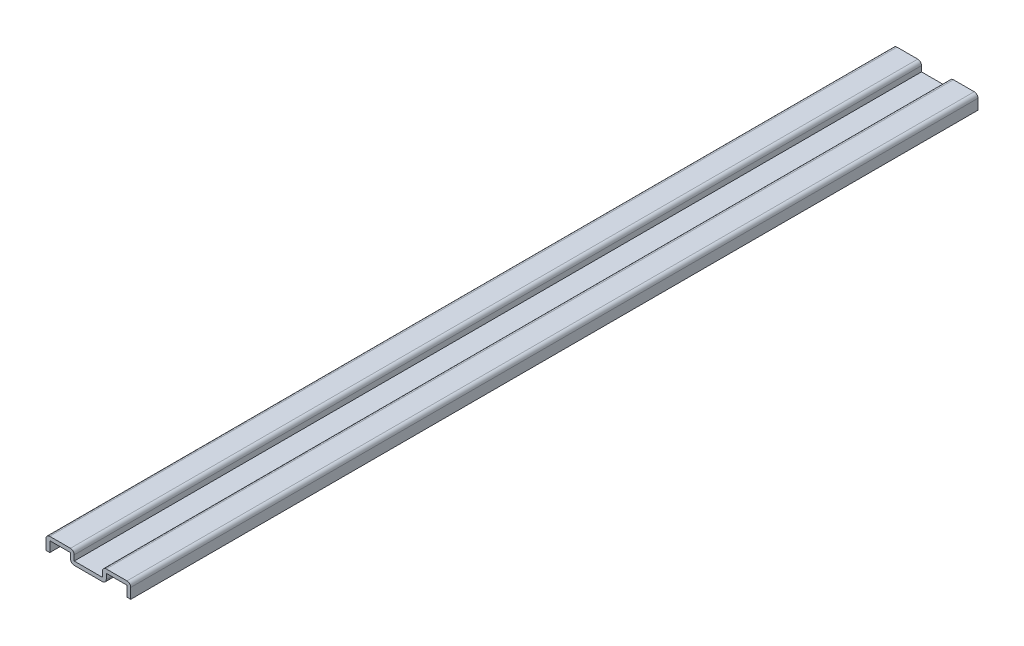
ISO-10303-21;
HEADER;
FILE_DESCRIPTION(('STEP AP214'),'2;1');
FILE_NAME('part.step','',(''),(''),'','','');
FILE_SCHEMA(('AUTOMOTIVE_DESIGN { 1 0 10303 214 1 1 1 1 }'));
ENDSEC;
DATA;
#1=APPLICATION_CONTEXT('core data for automotive mechanical design processes');
#2=APPLICATION_PROTOCOL_DEFINITION('international standard','automotive_design',2000,#1);
#3=PRODUCT_CONTEXT('',#1,'mechanical');
#4=PRODUCT('Part','Part','',(#3));
#5=PRODUCT_RELATED_PRODUCT_CATEGORY('part','',(#4));
#6=PRODUCT_DEFINITION_FORMATION('','',#4);
#7=PRODUCT_DEFINITION_CONTEXT('part definition',#1,'design');
#8=PRODUCT_DEFINITION('design','',#6,#7);
#9=PRODUCT_DEFINITION_SHAPE('','',#8);
#10=(LENGTH_UNIT() NAMED_UNIT(*) SI_UNIT(.MILLI.,.METRE.));
#11=(NAMED_UNIT(*) PLANE_ANGLE_UNIT() SI_UNIT($,.RADIAN.));
#12=(NAMED_UNIT(*) SI_UNIT($,.STERADIAN.) SOLID_ANGLE_UNIT());
#13=UNCERTAINTY_MEASURE_WITH_UNIT(LENGTH_MEASURE(1.E-05),#10,'distance_accuracy_value','');
#14=(GEOMETRIC_REPRESENTATION_CONTEXT(3) GLOBAL_UNCERTAINTY_ASSIGNED_CONTEXT((#13)) GLOBAL_UNIT_ASSIGNED_CONTEXT((#10,
#11,#12)) REPRESENTATION_CONTEXT('',''));
#15=CARTESIAN_POINT('',(0.,0.,0.));
#16=DIRECTION('',(0.,0.,1.));
#17=DIRECTION('',(1.,0.,0.));
#18=AXIS2_PLACEMENT_3D('',#15,#16,#17);
#19=CARTESIAN_POINT('',(-14.2875,0.,-285.75));
#20=DIRECTION('',(-1.,0.,0.));
#21=DIRECTION('',(0.,0.,1.));
#22=AXIS2_PLACEMENT_3D('',#19,#20,#21);
#23=PLANE('',#22);
#24=DIRECTION('',(0.,-1.,0.));
#25=VECTOR('',#24,1.);
#26=CARTESIAN_POINT('',(-14.2875,0.,0.));
#27=LINE('',#26,#25);
#28=CARTESIAN_POINT('',(-14.2875,3.4925,0.));
#29=VERTEX_POINT('',#28);
#30=CARTESIAN_POINT('',(-14.2875,0.,0.));
#31=VERTEX_POINT('',#30);
#32=EDGE_CURVE('E327',#29,#31,#27,.T.);
#33=ORIENTED_EDGE('',*,*,#32,.F.);
#34=DIRECTION('',(0.,0.,1.));
#35=VECTOR('',#34,1.);
#36=CARTESIAN_POINT('',(-14.2875,3.4925,-285.75));
#37=LINE('',#36,#35);
#38=CARTESIAN_POINT('',(-14.2875,3.4925,-285.75));
#39=VERTEX_POINT('',#38);
#40=EDGE_CURVE('E11',#29,#39,#37,.F.);
#41=ORIENTED_EDGE('',*,*,#40,.T.);
#42=DIRECTION('',(0.,-1.,0.));
#43=VECTOR('',#42,1.);
#44=CARTESIAN_POINT('',(-14.2875,0.,-285.75));
#45=LINE('',#44,#43);
#46=CARTESIAN_POINT('',(-14.2875,0.,-285.75));
#47=VERTEX_POINT('',#46);
#48=EDGE_CURVE('E185',#39,#47,#45,.T.);
#49=ORIENTED_EDGE('',*,*,#48,.T.);
#50=DIRECTION('',(0.,0.,1.));
#51=VECTOR('',#50,1.);
#52=CARTESIAN_POINT('',(-14.2875,0.,-285.75));
#53=LINE('',#52,#51);
#54=EDGE_CURVE('E189',#47,#31,#53,.T.);
#55=ORIENTED_EDGE('',*,*,#54,.T.);
#56=EDGE_LOOP('',(#33,#41,#49,#55));
#57=FACE_BOUND('',#56,.T.);
#58=ADVANCED_FACE('F35',(#57),#23,.T.);
#59=CARTESIAN_POINT('',(-14.2875,4.7625,-285.75));
#60=DIRECTION('',(0.,1.,0.));
#61=DIRECTION('',(0.,0.,1.));
#62=AXIS2_PLACEMENT_3D('',#59,#60,#61);
#63=PLANE('',#62);
#64=DIRECTION('',(-1.,0.,0.));
#65=VECTOR('',#64,1.);
#66=CARTESIAN_POINT('',(-14.2875,4.7625,0.));
#67=LINE('',#66,#65);
#68=CARTESIAN_POINT('',(-6.0325,4.7625,0.));
#69=VERTEX_POINT('',#68);
#70=CARTESIAN_POINT('',(-13.0175,4.7625,0.));
#71=VERTEX_POINT('',#70);
#72=EDGE_CURVE('E194',#69,#71,#67,.T.);
#73=ORIENTED_EDGE('',*,*,#72,.F.);
#74=DIRECTION('',(0.,0.,1.));
#75=VECTOR('',#74,1.);
#76=CARTESIAN_POINT('',(-6.0325,4.7625,-285.75));
#77=LINE('',#76,#75);
#78=CARTESIAN_POINT('',(-6.0325,4.7625,-285.75));
#79=VERTEX_POINT('',#78);
#80=EDGE_CURVE('E43',#69,#79,#77,.F.);
#81=ORIENTED_EDGE('',*,*,#80,.T.);
#82=DIRECTION('',(-1.,0.,0.));
#83=VECTOR('',#82,1.);
#84=CARTESIAN_POINT('',(-14.2875,4.7625,-285.75));
#85=LINE('',#84,#83);
#86=CARTESIAN_POINT('',(-13.0175,4.7625,-285.75));
#87=VERTEX_POINT('',#86);
#88=EDGE_CURVE('E209',#79,#87,#85,.T.);
#89=ORIENTED_EDGE('',*,*,#88,.T.);
#90=DIRECTION('',(0.,0.,1.));
#91=VECTOR('',#90,1.);
#92=CARTESIAN_POINT('',(-13.0175,4.7625,-285.75));
#93=LINE('',#92,#91);
#94=EDGE_CURVE('E264',#87,#71,#93,.T.);
#95=ORIENTED_EDGE('',*,*,#94,.T.);
#96=EDGE_LOOP('',(#73,#81,#89,#95));
#97=FACE_BOUND('',#96,.T.);
#98=ADVANCED_FACE('F270',(#97),#63,.T.);
#99=CARTESIAN_POINT('',(-4.7625,4.7625,-285.75));
#100=DIRECTION('',(1.,0.,0.));
#101=DIRECTION('',(0.,0.,-1.));
#102=AXIS2_PLACEMENT_3D('',#99,#100,#101);
#103=PLANE('',#102);
#104=DIRECTION('',(0.,1.,0.));
#105=VECTOR('',#104,1.);
#106=CARTESIAN_POINT('',(-4.7625,4.7625,-285.75));
#107=LINE('',#106,#105);
#108=CARTESIAN_POINT('',(-4.7625,1.666875,-285.75));
#109=VERTEX_POINT('',#108);
#110=CARTESIAN_POINT('',(-4.7625,3.4925,-285.75));
#111=VERTEX_POINT('',#110);
#112=EDGE_CURVE('E214',#109,#111,#107,.T.);
#113=ORIENTED_EDGE('',*,*,#112,.T.);
#114=DIRECTION('',(0.,0.,1.));
#115=VECTOR('',#114,1.);
#116=CARTESIAN_POINT('',(-4.7625,3.4925,-285.75));
#117=LINE('',#116,#115);
#118=CARTESIAN_POINT('',(-4.7625,3.4925,0.));
#119=VERTEX_POINT('',#118);
#120=EDGE_CURVE('E261',#111,#119,#117,.T.);
#121=ORIENTED_EDGE('',*,*,#120,.T.);
#122=DIRECTION('',(0.,1.,0.));
#123=VECTOR('',#122,1.);
#124=CARTESIAN_POINT('',(-4.7625,4.7625,0.));
#125=LINE('',#124,#123);
#126=CARTESIAN_POINT('',(-4.7625,1.666875,0.));
#127=VERTEX_POINT('',#126);
#128=EDGE_CURVE('E283',#127,#119,#125,.T.);
#129=ORIENTED_EDGE('',*,*,#128,.F.);
#130=DIRECTION('',(0.,0.,1.));
#131=VECTOR('',#130,1.);
#132=CARTESIAN_POINT('',(-4.7625,1.666875,-285.75));
#133=LINE('',#132,#131);
#134=EDGE_CURVE('E222',#109,#127,#133,.T.);
#135=ORIENTED_EDGE('',*,*,#134,.F.);
#136=EDGE_LOOP('',(#113,#121,#129,#135));
#137=FACE_BOUND('',#136,.T.);
#138=ADVANCED_FACE('F282',(#137),#103,.T.);
#139=CARTESIAN_POINT('',(-4.7625,1.666875,-285.75));
#140=DIRECTION('',(0.,1.,0.));
#141=DIRECTION('',(0.,0.,1.));
#142=AXIS2_PLACEMENT_3D('',#139,#140,#141);
#143=PLANE('',#142);
#144=DIRECTION('',(-1.,0.,0.));
#145=VECTOR('',#144,1.);
#146=CARTESIAN_POINT('',(-4.7625,1.666875,0.));
#147=LINE('',#146,#145);
#148=CARTESIAN_POINT('',(4.7625,1.666875,0.));
#149=VERTEX_POINT('',#148);
#150=EDGE_CURVE('E289',#149,#127,#147,.T.);
#151=ORIENTED_EDGE('',*,*,#150,.F.);
#152=DIRECTION('',(0.,0.,1.));
#153=VECTOR('',#152,1.);
#154=CARTESIAN_POINT('',(4.7625,1.666875,-285.75));
#155=LINE('',#154,#153);
#156=CARTESIAN_POINT('',(4.7625,1.666875,-285.75));
#157=VERTEX_POINT('',#156);
#158=EDGE_CURVE('E297',#157,#149,#155,.T.);
#159=ORIENTED_EDGE('',*,*,#158,.F.);
#160=DIRECTION('',(-1.,0.,0.));
#161=VECTOR('',#160,1.);
#162=CARTESIAN_POINT('',(-4.7625,1.666875,-285.75));
#163=LINE('',#162,#161);
#164=EDGE_CURVE('E358',#157,#109,#163,.T.);
#165=ORIENTED_EDGE('',*,*,#164,.T.);
#166=ORIENTED_EDGE('',*,*,#134,.T.);
#167=EDGE_LOOP('',(#151,#159,#165,#166));
#168=FACE_BOUND('',#167,.T.);
#169=ADVANCED_FACE('F357',(#168),#143,.T.);
#170=CARTESIAN_POINT('',(4.7625,4.7625,-285.75));
#171=DIRECTION('',(-1.,0.,0.));
#172=DIRECTION('',(0.,0.,1.));
#173=AXIS2_PLACEMENT_3D('',#170,#171,#172);
#174=PLANE('',#173);
#175=DIRECTION('',(0.,-1.,0.));
#176=VECTOR('',#175,1.);
#177=CARTESIAN_POINT('',(4.7625,4.7625,0.));
#178=LINE('',#177,#176);
#179=CARTESIAN_POINT('',(4.7625,3.4925,0.));
#180=VERTEX_POINT('',#179);
#181=EDGE_CURVE('E292',#180,#149,#178,.T.);
#182=ORIENTED_EDGE('',*,*,#181,.F.);
#183=DIRECTION('',(0.,0.,1.));
#184=VECTOR('',#183,1.);
#185=CARTESIAN_POINT('',(4.7625,3.4925,-285.75));
#186=LINE('',#185,#184);
#187=CARTESIAN_POINT('',(4.7625,3.4925,-285.75));
#188=VERTEX_POINT('',#187);
#189=EDGE_CURVE('E250',#180,#188,#186,.F.);
#190=ORIENTED_EDGE('',*,*,#189,.T.);
#191=DIRECTION('',(0.,-1.,0.));
#192=VECTOR('',#191,1.);
#193=CARTESIAN_POINT('',(4.7625,4.7625,-285.75));
#194=LINE('',#193,#192);
#195=EDGE_CURVE('E353',#188,#157,#194,.T.);
#196=ORIENTED_EDGE('',*,*,#195,.T.);
#197=ORIENTED_EDGE('',*,*,#158,.T.);
#198=EDGE_LOOP('',(#182,#190,#196,#197));
#199=FACE_BOUND('',#198,.T.);
#200=ADVANCED_FACE('F351',(#199),#174,.T.);
#201=CARTESIAN_POINT('',(14.2875,4.7625,-285.75));
#202=DIRECTION('',(0.,1.,0.));
#203=DIRECTION('',(0.,0.,1.));
#204=AXIS2_PLACEMENT_3D('',#201,#202,#203);
#205=PLANE('',#204);
#206=DIRECTION('',(-1.,0.,0.));
#207=VECTOR('',#206,1.);
#208=CARTESIAN_POINT('',(14.2875,4.7625,0.));
#209=LINE('',#208,#207);
#210=CARTESIAN_POINT('',(13.0175,4.7625,0.));
#211=VERTEX_POINT('',#210);
#212=CARTESIAN_POINT('',(6.0325,4.7625,0.));
#213=VERTEX_POINT('',#212);
#214=EDGE_CURVE('E345',#211,#213,#209,.T.);
#215=ORIENTED_EDGE('',*,*,#214,.F.);
#216=DIRECTION('',(0.,0.,1.));
#217=VECTOR('',#216,1.);
#218=CARTESIAN_POINT('',(13.0175,4.7625,-285.75));
#219=LINE('',#218,#217);
#220=CARTESIAN_POINT('',(13.0175,4.7625,-285.75));
#221=VERTEX_POINT('',#220);
#222=EDGE_CURVE('E237',#211,#221,#219,.F.);
#223=ORIENTED_EDGE('',*,*,#222,.T.);
#224=DIRECTION('',(-1.,0.,0.));
#225=VECTOR('',#224,1.);
#226=CARTESIAN_POINT('',(14.2875,4.7625,-285.75));
#227=LINE('',#226,#225);
#228=CARTESIAN_POINT('',(6.0325,4.7625,-285.75));
#229=VERTEX_POINT('',#228);
#230=EDGE_CURVE('E442',#221,#229,#227,.T.);
#231=ORIENTED_EDGE('',*,*,#230,.T.);
#232=DIRECTION('',(0.,0.,1.));
#233=VECTOR('',#232,1.);
#234=CARTESIAN_POINT('',(6.0325,4.7625,-285.75));
#235=LINE('',#234,#233);
#236=EDGE_CURVE('E234',#229,#213,#235,.T.);
#237=ORIENTED_EDGE('',*,*,#236,.T.);
#238=EDGE_LOOP('',(#215,#223,#231,#237));
#239=FACE_BOUND('',#238,.T.);
#240=ADVANCED_FACE('F438',(#239),#205,.T.);
#241=CARTESIAN_POINT('',(14.2875,0.,-285.75));
#242=DIRECTION('',(1.,0.,0.));
#243=DIRECTION('',(0.,0.,-1.));
#244=AXIS2_PLACEMENT_3D('',#241,#242,#243);
#245=PLANE('',#244);
#246=DIRECTION('',(0.,1.,0.));
#247=VECTOR('',#246,1.);
#248=CARTESIAN_POINT('',(14.2875,0.,-285.75));
#249=LINE('',#248,#247);
#250=CARTESIAN_POINT('',(14.2875,0.,-285.75));
#251=VERTEX_POINT('',#250);
#252=CARTESIAN_POINT('',(14.2875,3.4925,-285.75));
#253=VERTEX_POINT('',#252);
#254=EDGE_CURVE('E433',#251,#253,#249,.T.);
#255=ORIENTED_EDGE('',*,*,#254,.T.);
#256=DIRECTION('',(0.,0.,1.));
#257=VECTOR('',#256,1.);
#258=CARTESIAN_POINT('',(14.2875,3.4925,-285.75));
#259=LINE('',#258,#257);
#260=CARTESIAN_POINT('',(14.2875,3.4925,0.));
#261=VERTEX_POINT('',#260);
#262=EDGE_CURVE('E218',#253,#261,#259,.T.);
#263=ORIENTED_EDGE('',*,*,#262,.T.);
#264=DIRECTION('',(0.,1.,0.));
#265=VECTOR('',#264,1.);
#266=CARTESIAN_POINT('',(14.2875,0.,0.));
#267=LINE('',#266,#265);
#268=CARTESIAN_POINT('',(14.2875,0.,0.));
#269=VERTEX_POINT('',#268);
#270=EDGE_CURVE('E343',#269,#261,#267,.T.);
#271=ORIENTED_EDGE('',*,*,#270,.F.);
#272=DIRECTION('',(0.,0.,1.));
#273=VECTOR('',#272,1.);
#274=CARTESIAN_POINT('',(14.2875,0.,-285.75));
#275=LINE('',#274,#273);
#276=EDGE_CURVE('E300',#251,#269,#275,.T.);
#277=ORIENTED_EDGE('',*,*,#276,.F.);
#278=EDGE_LOOP('',(#255,#263,#271,#277));
#279=FACE_BOUND('',#278,.T.);
#280=ADVANCED_FACE('F432',(#279),#245,.T.);
#281=CARTESIAN_POINT('',(14.2875,0.,-285.75));
#282=DIRECTION('',(0.,1.,0.));
#283=DIRECTION('',(0.,0.,1.));
#284=AXIS2_PLACEMENT_3D('',#281,#282,#283);
#285=PLANE('',#284);
#286=DIRECTION('',(-1.,0.,0.));
#287=VECTOR('',#286,1.);
#288=CARTESIAN_POINT('',(14.2875,0.,0.));
#289=LINE('',#288,#287);
#290=CARTESIAN_POINT('',(13.0175,0.,0.));
#291=VERTEX_POINT('',#290);
#292=EDGE_CURVE('E341',#269,#291,#289,.T.);
#293=ORIENTED_EDGE('',*,*,#292,.T.);
#294=DIRECTION('',(0.,0.,1.));
#295=VECTOR('',#294,1.);
#296=CARTESIAN_POINT('',(13.0175,0.,-285.75));
#297=LINE('',#296,#295);
#298=CARTESIAN_POINT('',(13.0175,0.,-285.75));
#299=VERTEX_POINT('',#298);
#300=EDGE_CURVE('E302',#299,#291,#297,.T.);
#301=ORIENTED_EDGE('',*,*,#300,.F.);
#302=DIRECTION('',(-1.,0.,0.));
#303=VECTOR('',#302,1.);
#304=CARTESIAN_POINT('',(14.2875,0.,-285.75));
#305=LINE('',#304,#303);
#306=EDGE_CURVE('E428',#251,#299,#305,.T.);
#307=ORIENTED_EDGE('',*,*,#306,.F.);
#308=ORIENTED_EDGE('',*,*,#276,.T.);
#309=EDGE_LOOP('',(#293,#301,#307,#308));
#310=FACE_BOUND('',#309,.T.);
#311=ADVANCED_FACE('F427',(#310),#285,.F.);
#312=CARTESIAN_POINT('',(13.0175,0.,-285.75));
#313=DIRECTION('',(1.,0.,0.));
#314=DIRECTION('',(0.,0.,-1.));
#315=AXIS2_PLACEMENT_3D('',#312,#313,#314);
#316=PLANE('',#315);
#317=DIRECTION('',(0.,1.,0.));
#318=VECTOR('',#317,1.);
#319=CARTESIAN_POINT('',(13.0175,0.,0.));
#320=LINE('',#319,#318);
#321=CARTESIAN_POINT('',(13.0175,3.4925,0.));
#322=VERTEX_POINT('',#321);
#323=EDGE_CURVE('E339',#291,#322,#320,.T.);
#324=ORIENTED_EDGE('',*,*,#323,.T.);
#325=DIRECTION('',(0.,0.,1.));
#326=VECTOR('',#325,1.);
#327=CARTESIAN_POINT('',(13.0175,3.4925,-285.75));
#328=LINE('',#327,#326);
#329=CARTESIAN_POINT('',(13.0175,3.4925,-285.75));
#330=VERTEX_POINT('',#329);
#331=EDGE_CURVE('E305',#330,#322,#328,.T.);
#332=ORIENTED_EDGE('',*,*,#331,.F.);
#333=DIRECTION('',(0.,1.,0.));
#334=VECTOR('',#333,1.);
#335=CARTESIAN_POINT('',(13.0175,0.,-285.75));
#336=LINE('',#335,#334);
#337=EDGE_CURVE('E424',#299,#330,#336,.T.);
#338=ORIENTED_EDGE('',*,*,#337,.F.);
#339=ORIENTED_EDGE('',*,*,#300,.T.);
#340=EDGE_LOOP('',(#324,#332,#338,#339));
#341=FACE_BOUND('',#340,.T.);
#342=ADVANCED_FACE('F421',(#341),#316,.F.);
#343=CARTESIAN_POINT('',(14.2875,3.4925,-285.75));
#344=DIRECTION('',(0.,1.,0.));
#345=DIRECTION('',(0.,0.,1.));
#346=AXIS2_PLACEMENT_3D('',#343,#344,#345);
#347=PLANE('',#346);
#348=DIRECTION('',(1.,0.,0.));
#349=VECTOR('',#348,1.);
#350=CARTESIAN_POINT('',(14.2875,3.4925,0.));
#351=LINE('',#350,#349);
#352=CARTESIAN_POINT('',(6.0325,3.4925,0.));
#353=VERTEX_POINT('',#352);
#354=EDGE_CURVE('E337',#322,#353,#351,.F.);
#355=ORIENTED_EDGE('',*,*,#354,.T.);
#356=DIRECTION('',(0.,0.,1.));
#357=VECTOR('',#356,1.);
#358=CARTESIAN_POINT('',(6.0325,3.4925,-285.75));
#359=LINE('',#358,#357);
#360=CARTESIAN_POINT('',(6.0325,3.4925,-285.75));
#361=VERTEX_POINT('',#360);
#362=EDGE_CURVE('E308',#361,#353,#359,.T.);
#363=ORIENTED_EDGE('',*,*,#362,.F.);
#364=DIRECTION('',(1.,0.,0.));
#365=VECTOR('',#364,1.);
#366=CARTESIAN_POINT('',(14.2875,3.4925,-285.75));
#367=LINE('',#366,#365);
#368=EDGE_CURVE('E415',#330,#361,#367,.F.);
#369=ORIENTED_EDGE('',*,*,#368,.F.);
#370=ORIENTED_EDGE('',*,*,#331,.T.);
#371=EDGE_LOOP('',(#355,#363,#369,#370));
#372=FACE_BOUND('',#371,.T.);
#373=ADVANCED_FACE('F414',(#372),#347,.F.);
#374=CARTESIAN_POINT('',(6.0325,4.7625,-285.75));
#375=DIRECTION('',(-1.,0.,0.));
#376=DIRECTION('',(0.,0.,1.));
#377=AXIS2_PLACEMENT_3D('',#374,#375,#376);
#378=PLANE('',#377);
#379=DIRECTION('',(0.,1.,0.));
#380=VECTOR('',#379,1.);
#381=CARTESIAN_POINT('',(6.0325,4.7625,0.));
#382=LINE('',#381,#380);
#383=CARTESIAN_POINT('',(6.0325,1.666875,0.));
#384=VERTEX_POINT('',#383);
#385=EDGE_CURVE('E334',#353,#384,#382,.F.);
#386=ORIENTED_EDGE('',*,*,#385,.T.);
#387=DIRECTION('',(0.,0.,1.));
#388=VECTOR('',#387,1.);
#389=CARTESIAN_POINT('',(6.0325,1.666875,-285.75));
#390=LINE('',#389,#388);
#391=CARTESIAN_POINT('',(6.0325,1.666875,-285.75));
#392=VERTEX_POINT('',#391);
#393=EDGE_CURVE('E256',#384,#392,#390,.F.);
#394=ORIENTED_EDGE('',*,*,#393,.T.);
#395=DIRECTION('',(0.,1.,0.));
#396=VECTOR('',#395,1.);
#397=CARTESIAN_POINT('',(6.0325,4.7625,-285.75));
#398=LINE('',#397,#396);
#399=EDGE_CURVE('E411',#361,#392,#398,.F.);
#400=ORIENTED_EDGE('',*,*,#399,.F.);
#401=ORIENTED_EDGE('',*,*,#362,.T.);
#402=EDGE_LOOP('',(#386,#394,#400,#401));
#403=FACE_BOUND('',#402,.T.);
#404=ADVANCED_FACE('F407',(#403),#378,.F.);
#405=CARTESIAN_POINT('',(-4.7625,0.396875,-285.75));
#406=DIRECTION('',(0.,1.,0.));
#407=DIRECTION('',(0.,0.,1.));
#408=AXIS2_PLACEMENT_3D('',#405,#406,#407);
#409=PLANE('',#408);
#410=DIRECTION('',(1.,0.,0.));
#411=VECTOR('',#410,1.);
#412=CARTESIAN_POINT('',(-4.7625,0.396875,-285.75));
#413=LINE('',#412,#411);
#414=CARTESIAN_POINT('',(4.7625,0.396875,-285.75));
#415=VERTEX_POINT('',#414);
#416=CARTESIAN_POINT('',(-4.7625,0.396875,-285.75));
#417=VERTEX_POINT('',#416);
#418=EDGE_CURVE('E401',#415,#417,#413,.F.);
#419=ORIENTED_EDGE('',*,*,#418,.F.);
#420=DIRECTION('',(0.,0.,1.));
#421=VECTOR('',#420,1.);
#422=CARTESIAN_POINT('',(4.7625,0.396875,-285.75));
#423=LINE('',#422,#421);
#424=CARTESIAN_POINT('',(4.7625,0.396875,0.));
#425=VERTEX_POINT('',#424);
#426=EDGE_CURVE('E253',#415,#425,#423,.T.);
#427=ORIENTED_EDGE('',*,*,#426,.T.);
#428=DIRECTION('',(1.,0.,0.));
#429=VECTOR('',#428,1.);
#430=CARTESIAN_POINT('',(-4.7625,0.396875,0.));
#431=LINE('',#430,#429);
#432=CARTESIAN_POINT('',(-4.7625,0.396875,0.));
#433=VERTEX_POINT('',#432);
#434=EDGE_CURVE('E332',#425,#433,#431,.F.);
#435=ORIENTED_EDGE('',*,*,#434,.T.);
#436=DIRECTION('',(0.,0.,1.));
#437=VECTOR('',#436,1.);
#438=CARTESIAN_POINT('',(-4.7625,0.396875,-285.75));
#439=LINE('',#438,#437);
#440=EDGE_CURVE('E58',#433,#417,#439,.F.);
#441=ORIENTED_EDGE('',*,*,#440,.T.);
#442=EDGE_LOOP('',(#419,#427,#435,#441));
#443=FACE_BOUND('',#442,.T.);
#444=ADVANCED_FACE('F399',(#443),#409,.F.);
#445=CARTESIAN_POINT('',(-6.0325,4.7625,-285.75));
#446=DIRECTION('',(1.,0.,0.));
#447=DIRECTION('',(0.,0.,-1.));
#448=AXIS2_PLACEMENT_3D('',#445,#446,#447);
#449=PLANE('',#448);
#450=DIRECTION('',(0.,1.,0.));
#451=VECTOR('',#450,1.);
#452=CARTESIAN_POINT('',(-6.0325,4.7625,-285.75));
#453=LINE('',#452,#451);
#454=CARTESIAN_POINT('',(-6.0325,1.666875,-285.75));
#455=VERTEX_POINT('',#454);
#456=CARTESIAN_POINT('',(-6.0325,3.4925,-285.75));
#457=VERTEX_POINT('',#456);
#458=EDGE_CURVE('E397',#455,#457,#453,.T.);
#459=ORIENTED_EDGE('',*,*,#458,.F.);
#460=DIRECTION('',(0.,0.,1.));
#461=VECTOR('',#460,1.);
#462=CARTESIAN_POINT('',(-6.0325,1.666875,-285.75));
#463=LINE('',#462,#461);
#464=CARTESIAN_POINT('',(-6.0325,1.666875,0.));
#465=VERTEX_POINT('',#464);
#466=EDGE_CURVE('E258',#455,#465,#463,.T.);
#467=ORIENTED_EDGE('',*,*,#466,.T.);
#468=DIRECTION('',(0.,1.,0.));
#469=VECTOR('',#468,1.);
#470=CARTESIAN_POINT('',(-6.0325,4.7625,0.));
#471=LINE('',#470,#469);
#472=CARTESIAN_POINT('',(-6.0325,3.4925,0.));
#473=VERTEX_POINT('',#472);
#474=EDGE_CURVE('E325',#465,#473,#471,.T.);
#475=ORIENTED_EDGE('',*,*,#474,.T.);
#476=DIRECTION('',(0.,0.,1.));
#477=VECTOR('',#476,1.);
#478=CARTESIAN_POINT('',(-6.0325,3.4925,-285.75));
#479=LINE('',#478,#477);
#480=EDGE_CURVE('E311',#457,#473,#479,.T.);
#481=ORIENTED_EDGE('',*,*,#480,.F.);
#482=EDGE_LOOP('',(#459,#467,#475,#481));
#483=FACE_BOUND('',#482,.T.);
#484=ADVANCED_FACE('F395',(#483),#449,.F.);
#485=CARTESIAN_POINT('',(-14.2875,3.4925,-285.75));
#486=DIRECTION('',(0.,1.,0.));
#487=DIRECTION('',(0.,0.,1.));
#488=AXIS2_PLACEMENT_3D('',#485,#486,#487);
#489=PLANE('',#488);
#490=DIRECTION('',(1.,0.,0.));
#491=VECTOR('',#490,1.);
#492=CARTESIAN_POINT('',(-14.2875,3.4925,0.));
#493=LINE('',#492,#491);
#494=CARTESIAN_POINT('',(-13.0175,3.4925,0.));
#495=VERTEX_POINT('',#494);
#496=EDGE_CURVE('E323',#473,#495,#493,.F.);
#497=ORIENTED_EDGE('',*,*,#496,.T.);
#498=DIRECTION('',(0.,0.,1.));
#499=VECTOR('',#498,1.);
#500=CARTESIAN_POINT('',(-13.0175,3.4925,-285.75));
#501=LINE('',#500,#499);
#502=CARTESIAN_POINT('',(-13.0175,3.4925,-285.75));
#503=VERTEX_POINT('',#502);
#504=EDGE_CURVE('E211',#503,#495,#501,.T.);
#505=ORIENTED_EDGE('',*,*,#504,.F.);
#506=DIRECTION('',(1.,0.,0.));
#507=VECTOR('',#506,1.);
#508=CARTESIAN_POINT('',(-14.2875,3.4925,-285.75));
#509=LINE('',#508,#507);
#510=EDGE_CURVE('E453',#457,#503,#509,.F.);
#511=ORIENTED_EDGE('',*,*,#510,.F.);
#512=ORIENTED_EDGE('',*,*,#480,.T.);
#513=EDGE_LOOP('',(#497,#505,#511,#512));
#514=FACE_BOUND('',#513,.T.);
#515=ADVANCED_FACE('F455',(#514),#489,.F.);
#516=CARTESIAN_POINT('',(-13.0175,0.,-285.75));
#517=DIRECTION('',(-1.,0.,0.));
#518=DIRECTION('',(0.,0.,1.));
#519=AXIS2_PLACEMENT_3D('',#516,#517,#518);
#520=PLANE('',#519);
#521=DIRECTION('',(0.,1.,0.));
#522=VECTOR('',#521,1.);
#523=CARTESIAN_POINT('',(-13.0175,0.,0.));
#524=LINE('',#523,#522);
#525=CARTESIAN_POINT('',(-13.0175,0.,0.));
#526=VERTEX_POINT('',#525);
#527=EDGE_CURVE('E318',#495,#526,#524,.F.);
#528=ORIENTED_EDGE('',*,*,#527,.T.);
#529=DIRECTION('',(0.,0.,1.));
#530=VECTOR('',#529,1.);
#531=CARTESIAN_POINT('',(-13.0175,0.,-285.75));
#532=LINE('',#531,#530);
#533=CARTESIAN_POINT('',(-13.0175,0.,-285.75));
#534=VERTEX_POINT('',#533);
#535=EDGE_CURVE('E208',#534,#526,#532,.T.);
#536=ORIENTED_EDGE('',*,*,#535,.F.);
#537=DIRECTION('',(0.,1.,0.));
#538=VECTOR('',#537,1.);
#539=CARTESIAN_POINT('',(-13.0175,0.,-285.75));
#540=LINE('',#539,#538);
#541=EDGE_CURVE('E200',#503,#534,#540,.F.);
#542=ORIENTED_EDGE('',*,*,#541,.F.);
#543=ORIENTED_EDGE('',*,*,#504,.T.);
#544=EDGE_LOOP('',(#528,#536,#542,#543));
#545=FACE_BOUND('',#544,.T.);
#546=ADVANCED_FACE('F317',(#545),#520,.F.);
#547=CARTESIAN_POINT('',(-13.0175,0.,-285.75));
#548=DIRECTION('',(0.,1.,0.));
#549=DIRECTION('',(0.,0.,1.));
#550=AXIS2_PLACEMENT_3D('',#547,#548,#549);
#551=PLANE('',#550);
#552=DIRECTION('',(-1.,0.,0.));
#553=VECTOR('',#552,1.);
#554=CARTESIAN_POINT('',(-13.0175,0.,0.));
#555=LINE('',#554,#553);
#556=EDGE_CURVE('E207',#526,#31,#555,.T.);
#557=ORIENTED_EDGE('',*,*,#556,.T.);
#558=ORIENTED_EDGE('',*,*,#54,.F.);
#559=DIRECTION('',(-1.,0.,0.));
#560=VECTOR('',#559,1.);
#561=CARTESIAN_POINT('',(-13.0175,0.,-285.75));
#562=LINE('',#561,#560);
#563=EDGE_CURVE('E193',#534,#47,#562,.T.);
#564=ORIENTED_EDGE('',*,*,#563,.F.);
#565=ORIENTED_EDGE('',*,*,#535,.T.);
#566=EDGE_LOOP('',(#557,#558,#564,#565));
#567=FACE_BOUND('',#566,.T.);
#568=ADVANCED_FACE('F205',(#567),#551,.F.);
#569=CARTESIAN_POINT('',(0.,0.,-285.75));
#570=DIRECTION('',(0.,0.,-1.));
#571=DIRECTION('',(-1.,0.,0.));
#572=AXIS2_PLACEMENT_3D('',#569,#570,#571);
#573=PLANE('',#572);
#574=ORIENTED_EDGE('',*,*,#230,.F.);
#575=CARTESIAN_POINT('',(13.0175,3.4925,-285.75));
#576=DIRECTION('',(0.,0.,-1.));
#577=DIRECTION('',(-1.,0.,0.));
#578=AXIS2_PLACEMENT_3D('',#575,#576,#577);
#579=CIRCLE('',#578,1.27);
#580=EDGE_CURVE('E248',#221,#253,#579,.T.);
#581=ORIENTED_EDGE('',*,*,#580,.T.);
#582=ORIENTED_EDGE('',*,*,#254,.F.);
#583=ORIENTED_EDGE('',*,*,#306,.T.);
#584=ORIENTED_EDGE('',*,*,#337,.T.);
#585=ORIENTED_EDGE('',*,*,#368,.T.);
#586=ORIENTED_EDGE('',*,*,#399,.T.);
#587=CARTESIAN_POINT('',(4.7625,1.666875,-285.75));
#588=DIRECTION('',(0.,0.,-1.));
#589=DIRECTION('',(-1.,0.,0.));
#590=AXIS2_PLACEMENT_3D('',#587,#588,#589);
#591=CIRCLE('',#590,1.27);
#592=EDGE_CURVE('E244',#392,#415,#591,.T.);
#593=ORIENTED_EDGE('',*,*,#592,.T.);
#594=ORIENTED_EDGE('',*,*,#418,.T.);
#595=CARTESIAN_POINT('',(-4.7625,1.666875,-285.75));
#596=DIRECTION('',(0.,0.,-1.));
#597=DIRECTION('',(-1.,0.,0.));
#598=AXIS2_PLACEMENT_3D('',#595,#596,#597);
#599=CIRCLE('',#598,1.27);
#600=EDGE_CURVE('E50',#417,#455,#599,.T.);
#601=ORIENTED_EDGE('',*,*,#600,.T.);
#602=ORIENTED_EDGE('',*,*,#458,.T.);
#603=ORIENTED_EDGE('',*,*,#510,.T.);
#604=ORIENTED_EDGE('',*,*,#541,.T.);
#605=ORIENTED_EDGE('',*,*,#563,.T.);
#606=ORIENTED_EDGE('',*,*,#48,.F.);
#607=CARTESIAN_POINT('',(-13.0175,3.4925,-285.75));
#608=DIRECTION('',(0.,0.,-1.));
#609=DIRECTION('',(-1.,0.,0.));
#610=AXIS2_PLACEMENT_3D('',#607,#608,#609);
#611=CIRCLE('',#610,1.27);
#612=EDGE_CURVE('E239',#39,#87,#611,.T.);
#613=ORIENTED_EDGE('',*,*,#612,.T.);
#614=ORIENTED_EDGE('',*,*,#88,.F.);
#615=CARTESIAN_POINT('',(-6.0325,3.4925,-285.75));
#616=DIRECTION('',(0.,0.,-1.));
#617=DIRECTION('',(-1.,0.,0.));
#618=AXIS2_PLACEMENT_3D('',#615,#616,#617);
#619=CIRCLE('',#618,1.27);
#620=EDGE_CURVE('E241',#79,#111,#619,.T.);
#621=ORIENTED_EDGE('',*,*,#620,.T.);
#622=ORIENTED_EDGE('',*,*,#112,.F.);
#623=ORIENTED_EDGE('',*,*,#164,.F.);
#624=ORIENTED_EDGE('',*,*,#195,.F.);
#625=CARTESIAN_POINT('',(6.0325,3.4925,-285.75));
#626=DIRECTION('',(0.,0.,-1.));
#627=DIRECTION('',(-1.,0.,0.));
#628=AXIS2_PLACEMENT_3D('',#625,#626,#627);
#629=CIRCLE('',#628,1.27);
#630=EDGE_CURVE('E246',#188,#229,#629,.T.);
#631=ORIENTED_EDGE('',*,*,#630,.T.);
#632=EDGE_LOOP('',(#574,#581,#582,#583,#584,#585,#586,#593,#594,#601,#602,#603,#604,#605,#606,
#613,#614,#621,#622,#623,#624,#631));
#633=FACE_BOUND('',#632,.T.);
#634=ADVANCED_FACE('F198',(#633),#573,.T.);
#635=CARTESIAN_POINT('',(0.,0.,0.));
#636=DIRECTION('',(0.,0.,-1.));
#637=DIRECTION('',(-1.,0.,0.));
#638=AXIS2_PLACEMENT_3D('',#635,#636,#637);
#639=PLANE('',#638);
#640=ORIENTED_EDGE('',*,*,#270,.T.);
#641=CARTESIAN_POINT('',(13.0175,3.4925,0.));
#642=DIRECTION('',(0.,0.,-1.));
#643=DIRECTION('',(-1.,0.,0.));
#644=AXIS2_PLACEMENT_3D('',#641,#642,#643);
#645=CIRCLE('',#644,1.27);
#646=EDGE_CURVE('E232',#261,#211,#645,.F.);
#647=ORIENTED_EDGE('',*,*,#646,.T.);
#648=ORIENTED_EDGE('',*,*,#214,.T.);
#649=CARTESIAN_POINT('',(6.0325,3.4925,0.));
#650=DIRECTION('',(0.,0.,-1.));
#651=DIRECTION('',(-1.,0.,0.));
#652=AXIS2_PLACEMENT_3D('',#649,#650,#651);
#653=CIRCLE('',#652,1.27);
#654=EDGE_CURVE('E230',#213,#180,#653,.F.);
#655=ORIENTED_EDGE('',*,*,#654,.T.);
#656=ORIENTED_EDGE('',*,*,#181,.T.);
#657=ORIENTED_EDGE('',*,*,#150,.T.);
#658=ORIENTED_EDGE('',*,*,#128,.T.);
#659=CARTESIAN_POINT('',(-6.0325,3.4925,0.));
#660=DIRECTION('',(0.,0.,-1.));
#661=DIRECTION('',(-1.,0.,0.));
#662=AXIS2_PLACEMENT_3D('',#659,#660,#661);
#663=CIRCLE('',#662,1.27);
#664=EDGE_CURVE('E224',#119,#69,#663,.F.);
#665=ORIENTED_EDGE('',*,*,#664,.T.);
#666=ORIENTED_EDGE('',*,*,#72,.T.);
#667=CARTESIAN_POINT('',(-13.0175,3.4925,0.));
#668=DIRECTION('',(0.,0.,-1.));
#669=DIRECTION('',(-1.,0.,0.));
#670=AXIS2_PLACEMENT_3D('',#667,#668,#669);
#671=CIRCLE('',#670,1.27);
#672=EDGE_CURVE('E221',#71,#29,#671,.F.);
#673=ORIENTED_EDGE('',*,*,#672,.T.);
#674=ORIENTED_EDGE('',*,*,#32,.T.);
#675=ORIENTED_EDGE('',*,*,#556,.F.);
#676=ORIENTED_EDGE('',*,*,#527,.F.);
#677=ORIENTED_EDGE('',*,*,#496,.F.);
#678=ORIENTED_EDGE('',*,*,#474,.F.);
#679=CARTESIAN_POINT('',(-4.7625,1.666875,0.));
#680=DIRECTION('',(0.,0.,-1.));
#681=DIRECTION('',(-1.,0.,0.));
#682=AXIS2_PLACEMENT_3D('',#679,#680,#681);
#683=CIRCLE('',#682,1.27);
#684=EDGE_CURVE('E226',#465,#433,#683,.F.);
#685=ORIENTED_EDGE('',*,*,#684,.T.);
#686=ORIENTED_EDGE('',*,*,#434,.F.);
#687=CARTESIAN_POINT('',(4.7625,1.666875,0.));
#688=DIRECTION('',(0.,0.,-1.));
#689=DIRECTION('',(-1.,0.,0.));
#690=AXIS2_PLACEMENT_3D('',#687,#688,#689);
#691=CIRCLE('',#690,1.27);
#692=EDGE_CURVE('E228',#425,#384,#691,.F.);
#693=ORIENTED_EDGE('',*,*,#692,.T.);
#694=ORIENTED_EDGE('',*,*,#385,.F.);
#695=ORIENTED_EDGE('',*,*,#354,.F.);
#696=ORIENTED_EDGE('',*,*,#323,.F.);
#697=ORIENTED_EDGE('',*,*,#292,.F.);
#698=EDGE_LOOP('',(#640,#647,#648,#655,#656,#657,#658,#665,#666,#673,#674,#675,#676,#677,#678,
#685,#686,#693,#694,#695,#696,#697));
#699=FACE_BOUND('',#698,.T.);
#700=ADVANCED_FACE('F287',(#699),#639,.F.);
#701=CARTESIAN_POINT('',(13.0175,3.4925,-285.75));
#702=DIRECTION('',(0.,0.,1.));
#703=DIRECTION('',(1.,0.,0.));
#704=AXIS2_PLACEMENT_3D('',#701,#702,#703);
#705=CYLINDRICAL_SURFACE('',#704,1.27);
#706=ORIENTED_EDGE('',*,*,#580,.F.);
#707=ORIENTED_EDGE('',*,*,#222,.F.);
#708=ORIENTED_EDGE('',*,*,#646,.F.);
#709=ORIENTED_EDGE('',*,*,#262,.F.);
#710=EDGE_LOOP('',(#706,#707,#708,#709));
#711=FACE_BOUND('',#710,.T.);
#712=ADVANCED_FACE('F377',(#711),#705,.T.);
#713=CARTESIAN_POINT('',(6.0325,3.4925,-285.75));
#714=DIRECTION('',(0.,0.,1.));
#715=DIRECTION('',(1.,0.,0.));
#716=AXIS2_PLACEMENT_3D('',#713,#714,#715);
#717=CYLINDRICAL_SURFACE('',#716,1.27);
#718=ORIENTED_EDGE('',*,*,#630,.F.);
#719=ORIENTED_EDGE('',*,*,#189,.F.);
#720=ORIENTED_EDGE('',*,*,#654,.F.);
#721=ORIENTED_EDGE('',*,*,#236,.F.);
#722=EDGE_LOOP('',(#718,#719,#720,#721));
#723=FACE_BOUND('',#722,.T.);
#724=ADVANCED_FACE('F380',(#723),#717,.T.);
#725=CARTESIAN_POINT('',(4.7625,1.666875,-285.75));
#726=DIRECTION('',(0.,0.,1.));
#727=DIRECTION('',(1.,0.,0.));
#728=AXIS2_PLACEMENT_3D('',#725,#726,#727);
#729=CYLINDRICAL_SURFACE('',#728,1.27);
#730=ORIENTED_EDGE('',*,*,#592,.F.);
#731=ORIENTED_EDGE('',*,*,#393,.F.);
#732=ORIENTED_EDGE('',*,*,#692,.F.);
#733=ORIENTED_EDGE('',*,*,#426,.F.);
#734=EDGE_LOOP('',(#730,#731,#732,#733));
#735=FACE_BOUND('',#734,.T.);
#736=ADVANCED_FACE('F384',(#735),#729,.T.);
#737=CARTESIAN_POINT('',(-4.7625,1.666875,-285.75));
#738=DIRECTION('',(0.,0.,1.));
#739=DIRECTION('',(1.,0.,0.));
#740=AXIS2_PLACEMENT_3D('',#737,#738,#739);
#741=CYLINDRICAL_SURFACE('',#740,1.27);
#742=ORIENTED_EDGE('',*,*,#600,.F.);
#743=ORIENTED_EDGE('',*,*,#440,.F.);
#744=ORIENTED_EDGE('',*,*,#684,.F.);
#745=ORIENTED_EDGE('',*,*,#466,.F.);
#746=EDGE_LOOP('',(#742,#743,#744,#745));
#747=FACE_BOUND('',#746,.T.);
#748=ADVANCED_FACE('F367',(#747),#741,.T.);
#749=CARTESIAN_POINT('',(-6.0325,3.4925,-285.75));
#750=DIRECTION('',(0.,0.,1.));
#751=DIRECTION('',(1.,0.,0.));
#752=AXIS2_PLACEMENT_3D('',#749,#750,#751);
#753=CYLINDRICAL_SURFACE('',#752,1.27);
#754=ORIENTED_EDGE('',*,*,#620,.F.);
#755=ORIENTED_EDGE('',*,*,#80,.F.);
#756=ORIENTED_EDGE('',*,*,#664,.F.);
#757=ORIENTED_EDGE('',*,*,#120,.F.);
#758=EDGE_LOOP('',(#754,#755,#756,#757));
#759=FACE_BOUND('',#758,.T.);
#760=ADVANCED_FACE('F278',(#759),#753,.T.);
#761=CARTESIAN_POINT('',(-13.0175,3.4925,-285.75));
#762=DIRECTION('',(0.,0.,1.));
#763=DIRECTION('',(1.,0.,0.));
#764=AXIS2_PLACEMENT_3D('',#761,#762,#763);
#765=CYLINDRICAL_SURFACE('',#764,1.27);
#766=ORIENTED_EDGE('',*,*,#612,.F.);
#767=ORIENTED_EDGE('',*,*,#40,.F.);
#768=ORIENTED_EDGE('',*,*,#672,.F.);
#769=ORIENTED_EDGE('',*,*,#94,.F.);
#770=EDGE_LOOP('',(#766,#767,#768,#769));
#771=FACE_BOUND('',#770,.T.);
#772=ADVANCED_FACE('F37',(#771),#765,.T.);
#773=CLOSED_SHELL('',(#58,#98,#138,#169,#200,#240,#280,#311,#342,#373,#404,#444,#484,#515,#546,
#568,#634,#700,#712,#724,#736,#748,#760,#772));
#774=MANIFOLD_SOLID_BREP('B2',#773);
#775=ADVANCED_BREP_SHAPE_REPRESENTATION('',(#18,#774),#14);
#776=SHAPE_DEFINITION_REPRESENTATION(#9,#775);
ENDSEC;
END-ISO-10303-21;
